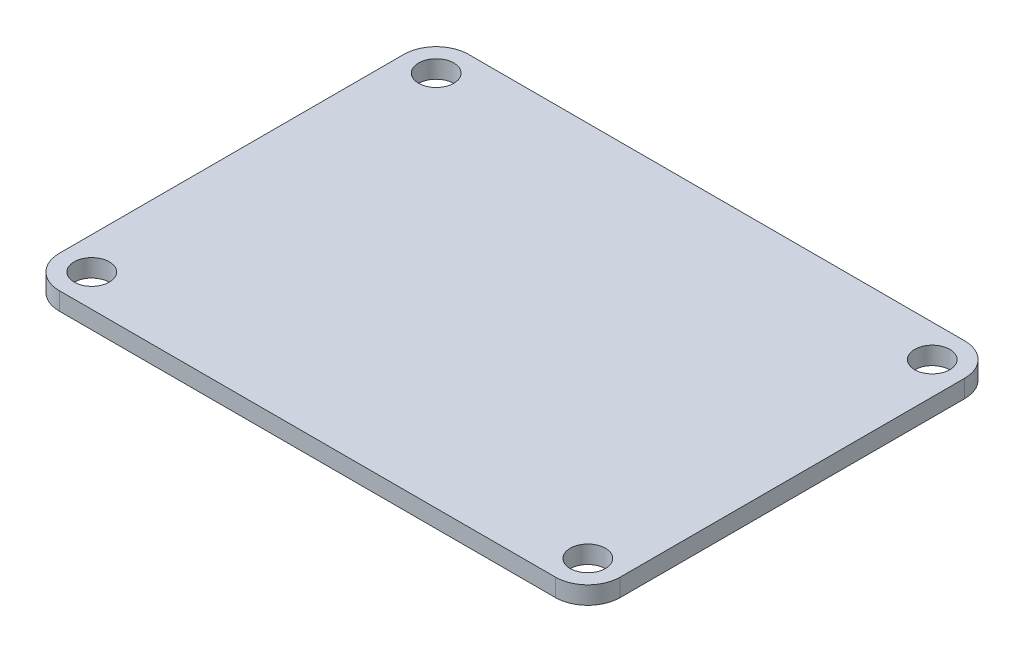
ISO-10303-21;
HEADER;
FILE_DESCRIPTION(('STEP AP214'),'2;1');
FILE_NAME('part.step','',(''),(''),'','','');
FILE_SCHEMA(('AUTOMOTIVE_DESIGN { 1 0 10303 214 1 1 1 1 }'));
ENDSEC;
DATA;
#1=APPLICATION_CONTEXT('core data for automotive mechanical design processes');
#2=APPLICATION_PROTOCOL_DEFINITION('international standard','automotive_design',2000,#1);
#3=PRODUCT_CONTEXT('',#1,'mechanical');
#4=PRODUCT('Part','Part','',(#3));
#5=PRODUCT_RELATED_PRODUCT_CATEGORY('part','',(#4));
#6=PRODUCT_DEFINITION_FORMATION('','',#4);
#7=PRODUCT_DEFINITION_CONTEXT('part definition',#1,'design');
#8=PRODUCT_DEFINITION('design','',#6,#7);
#9=PRODUCT_DEFINITION_SHAPE('','',#8);
#10=(LENGTH_UNIT() NAMED_UNIT(*) SI_UNIT(.MILLI.,.METRE.));
#11=(NAMED_UNIT(*) PLANE_ANGLE_UNIT() SI_UNIT($,.RADIAN.));
#12=(NAMED_UNIT(*) SI_UNIT($,.STERADIAN.) SOLID_ANGLE_UNIT());
#13=UNCERTAINTY_MEASURE_WITH_UNIT(LENGTH_MEASURE(1.E-05),#10,'distance_accuracy_value','');
#14=(GEOMETRIC_REPRESENTATION_CONTEXT(3) GLOBAL_UNCERTAINTY_ASSIGNED_CONTEXT((#13)) GLOBAL_UNIT_ASSIGNED_CONTEXT((#10,
#11,#12)) REPRESENTATION_CONTEXT('',''));
#15=CARTESIAN_POINT('',(0.,0.,0.));
#16=DIRECTION('',(0.,0.,1.));
#17=DIRECTION('',(1.,0.,0.));
#18=AXIS2_PLACEMENT_3D('',#15,#16,#17);
#19=CARTESIAN_POINT('',(0.,0.,0.));
#20=DIRECTION('',(0.,-1.,0.));
#21=DIRECTION('',(0.,0.,-1.));
#22=AXIS2_PLACEMENT_3D('',#19,#20,#21);
#23=PLANE('',#22);
#24=CARTESIAN_POINT('',(-22.352,0.,-15.5194));
#25=DIRECTION('',(0.,1.,0.));
#26=DIRECTION('',(0.,0.,1.));
#27=AXIS2_PLACEMENT_3D('',#24,#25,#26);
#28=CIRCLE('',#27,2.921);
#29=CARTESIAN_POINT('',(-22.352,0.,-18.4404));
#30=VERTEX_POINT('',#29);
#31=CARTESIAN_POINT('',(-25.273,0.,-15.5194));
#32=VERTEX_POINT('',#31);
#33=EDGE_CURVE('E116',#30,#32,#28,.T.);
#34=ORIENTED_EDGE('',*,*,#33,.F.);
#35=DIRECTION('',(-1.,0.,0.));
#36=VECTOR('',#35,1.);
#37=CARTESIAN_POINT('',(-25.273,0.,-18.4404));
#38=LINE('',#37,#36);
#39=CARTESIAN_POINT('',(22.352,0.,-18.4404));
#40=VERTEX_POINT('',#39);
#41=EDGE_CURVE('E110',#40,#30,#38,.T.);
#42=ORIENTED_EDGE('',*,*,#41,.F.);
#43=CARTESIAN_POINT('',(22.352,0.,-15.5194));
#44=DIRECTION('',(0.,1.,0.));
#45=DIRECTION('',(0.,0.,1.));
#46=AXIS2_PLACEMENT_3D('',#43,#44,#45);
#47=CIRCLE('',#46,2.921);
#48=CARTESIAN_POINT('',(25.273,0.,-15.5194));
#49=VERTEX_POINT('',#48);
#50=EDGE_CURVE('E142',#49,#40,#47,.T.);
#51=ORIENTED_EDGE('',*,*,#50,.F.);
#52=DIRECTION('',(0.,0.,-1.));
#53=VECTOR('',#52,1.);
#54=CARTESIAN_POINT('',(25.273,0.,-18.4404));
#55=LINE('',#54,#53);
#56=CARTESIAN_POINT('',(25.273,0.,15.5194));
#57=VERTEX_POINT('',#56);
#58=EDGE_CURVE('E85',#57,#49,#55,.T.);
#59=ORIENTED_EDGE('',*,*,#58,.F.);
#60=CARTESIAN_POINT('',(22.352,0.,15.5194));
#61=DIRECTION('',(0.,1.,0.));
#62=DIRECTION('',(0.,0.,1.));
#63=AXIS2_PLACEMENT_3D('',#60,#61,#62);
#64=CIRCLE('',#63,2.921);
#65=CARTESIAN_POINT('',(22.352,0.,18.4404));
#66=VERTEX_POINT('',#65);
#67=EDGE_CURVE('E79',#66,#57,#64,.T.);
#68=ORIENTED_EDGE('',*,*,#67,.F.);
#69=DIRECTION('',(-1.,0.,0.));
#70=VECTOR('',#69,1.);
#71=CARTESIAN_POINT('',(-25.273,0.,18.4404));
#72=LINE('',#71,#70);
#73=CARTESIAN_POINT('',(-22.352,0.,18.4404));
#74=VERTEX_POINT('',#73);
#75=EDGE_CURVE('E83',#66,#74,#72,.T.);
#76=ORIENTED_EDGE('',*,*,#75,.T.);
#77=CARTESIAN_POINT('',(-22.352,0.,15.5194));
#78=DIRECTION('',(0.,1.,0.));
#79=DIRECTION('',(0.,0.,1.));
#80=AXIS2_PLACEMENT_3D('',#77,#78,#79);
#81=CIRCLE('',#80,2.921);
#82=CARTESIAN_POINT('',(-25.273,0.,15.5194));
#83=VERTEX_POINT('',#82);
#84=EDGE_CURVE('E98',#83,#74,#81,.T.);
#85=ORIENTED_EDGE('',*,*,#84,.F.);
#86=DIRECTION('',(0.,0.,-1.));
#87=VECTOR('',#86,1.);
#88=CARTESIAN_POINT('',(-25.273,0.,-18.4404));
#89=LINE('',#88,#87);
#90=EDGE_CURVE('E114',#83,#32,#89,.T.);
#91=ORIENTED_EDGE('',*,*,#90,.T.);
#92=EDGE_LOOP('',(#34,#42,#51,#59,#68,#76,#85,#91));
#93=FACE_BOUND('',#92,.T.);
#94=CARTESIAN_POINT('',(22.352,0.,-15.5194));
#95=DIRECTION('',(0.,1.,0.));
#96=DIRECTION('',(0.,0.,1.));
#97=AXIS2_PLACEMENT_3D('',#94,#95,#96);
#98=CIRCLE('',#97,1.5875);
#99=CARTESIAN_POINT('',(22.352,0.,-13.9319));
#100=VERTEX_POINT('',#99);
#101=EDGE_CURVE('E149',#100,#100,#98,.T.);
#102=ORIENTED_EDGE('',*,*,#101,.T.);
#103=EDGE_LOOP('',(#102));
#104=FACE_BOUND('',#103,.T.);
#105=CARTESIAN_POINT('',(22.352,0.,15.5194));
#106=DIRECTION('',(0.,1.,0.));
#107=DIRECTION('',(0.,0.,1.));
#108=AXIS2_PLACEMENT_3D('',#105,#106,#107);
#109=CIRCLE('',#108,1.5875);
#110=CARTESIAN_POINT('',(22.352,0.,17.1069));
#111=VERTEX_POINT('',#110);
#112=EDGE_CURVE('E91',#111,#111,#109,.T.);
#113=ORIENTED_EDGE('',*,*,#112,.T.);
#114=EDGE_LOOP('',(#113));
#115=FACE_BOUND('',#114,.T.);
#116=CARTESIAN_POINT('',(-22.352,0.,-15.5194));
#117=DIRECTION('',(0.,1.,0.));
#118=DIRECTION('',(0.,0.,1.));
#119=AXIS2_PLACEMENT_3D('',#116,#117,#118);
#120=CIRCLE('',#119,1.5875);
#121=CARTESIAN_POINT('',(-22.352,0.,-13.9319));
#122=VERTEX_POINT('',#121);
#123=EDGE_CURVE('E151',#122,#122,#120,.T.);
#124=ORIENTED_EDGE('',*,*,#123,.T.);
#125=EDGE_LOOP('',(#124));
#126=FACE_BOUND('',#125,.T.);
#127=CARTESIAN_POINT('',(-22.352,0.,15.5194));
#128=DIRECTION('',(0.,1.,0.));
#129=DIRECTION('',(0.,0.,1.));
#130=AXIS2_PLACEMENT_3D('',#127,#128,#129);
#131=CIRCLE('',#130,1.5875);
#132=CARTESIAN_POINT('',(-22.352,0.,17.1069));
#133=VERTEX_POINT('',#132);
#134=EDGE_CURVE('E19',#133,#133,#131,.T.);
#135=ORIENTED_EDGE('',*,*,#134,.T.);
#136=EDGE_LOOP('',(#135));
#137=FACE_BOUND('',#136,.T.);
#138=ADVANCED_FACE('F16',(#93,#104,#115,#126,#137),#23,.T.);
#139=CARTESIAN_POINT('',(-22.352,0.,15.5194));
#140=DIRECTION('',(0.,1.,0.));
#141=DIRECTION('',(0.,0.,1.));
#142=AXIS2_PLACEMENT_3D('',#139,#140,#141);
#143=CYLINDRICAL_SURFACE('',#142,1.5875);
#144=ORIENTED_EDGE('',*,*,#134,.F.);
#145=EDGE_LOOP('',(#144));
#146=FACE_BOUND('',#145,.T.);
#147=CARTESIAN_POINT('',(-22.352,1.6002,15.5194));
#148=DIRECTION('',(0.,1.,0.));
#149=DIRECTION('',(0.,0.,1.));
#150=AXIS2_PLACEMENT_3D('',#147,#148,#149);
#151=CIRCLE('',#150,1.5875);
#152=CARTESIAN_POINT('',(-22.352,1.6002,17.1069));
#153=VERTEX_POINT('',#152);
#154=EDGE_CURVE('E108',#153,#153,#151,.T.);
#155=ORIENTED_EDGE('',*,*,#154,.T.);
#156=EDGE_LOOP('',(#155));
#157=FACE_BOUND('',#156,.T.);
#158=ADVANCED_FACE('F159',(#146,#157),#143,.F.);
#159=CARTESIAN_POINT('',(-22.352,0.,-15.5194));
#160=DIRECTION('',(0.,1.,0.));
#161=DIRECTION('',(0.,0.,1.));
#162=AXIS2_PLACEMENT_3D('',#159,#160,#161);
#163=CYLINDRICAL_SURFACE('',#162,1.5875);
#164=ORIENTED_EDGE('',*,*,#123,.F.);
#165=EDGE_LOOP('',(#164));
#166=FACE_BOUND('',#165,.T.);
#167=CARTESIAN_POINT('',(-22.352,1.6002,-15.5194));
#168=DIRECTION('',(0.,1.,0.));
#169=DIRECTION('',(0.,0.,1.));
#170=AXIS2_PLACEMENT_3D('',#167,#168,#169);
#171=CIRCLE('',#170,1.5875);
#172=CARTESIAN_POINT('',(-22.352,1.6002,-13.9319));
#173=VERTEX_POINT('',#172);
#174=EDGE_CURVE('E137',#173,#173,#171,.T.);
#175=ORIENTED_EDGE('',*,*,#174,.T.);
#176=EDGE_LOOP('',(#175));
#177=FACE_BOUND('',#176,.T.);
#178=ADVANCED_FACE('F162',(#166,#177),#163,.F.);
#179=CARTESIAN_POINT('',(22.352,0.,-15.5194));
#180=DIRECTION('',(0.,1.,0.));
#181=DIRECTION('',(0.,0.,1.));
#182=AXIS2_PLACEMENT_3D('',#179,#180,#181);
#183=CYLINDRICAL_SURFACE('',#182,1.5875);
#184=ORIENTED_EDGE('',*,*,#101,.F.);
#185=EDGE_LOOP('',(#184));
#186=FACE_BOUND('',#185,.T.);
#187=CARTESIAN_POINT('',(22.352,1.6002,-15.5194));
#188=DIRECTION('',(0.,1.,0.));
#189=DIRECTION('',(0.,0.,1.));
#190=AXIS2_PLACEMENT_3D('',#187,#188,#189);
#191=CIRCLE('',#190,1.5875);
#192=CARTESIAN_POINT('',(22.352,1.6002,-13.9319));
#193=VERTEX_POINT('',#192);
#194=EDGE_CURVE('E134',#193,#193,#191,.T.);
#195=ORIENTED_EDGE('',*,*,#194,.T.);
#196=EDGE_LOOP('',(#195));
#197=FACE_BOUND('',#196,.T.);
#198=ADVANCED_FACE('F205',(#186,#197),#183,.F.);
#199=CARTESIAN_POINT('',(22.352,0.,15.5194));
#200=DIRECTION('',(0.,1.,0.));
#201=DIRECTION('',(0.,0.,1.));
#202=AXIS2_PLACEMENT_3D('',#199,#200,#201);
#203=CYLINDRICAL_SURFACE('',#202,1.5875);
#204=ORIENTED_EDGE('',*,*,#112,.F.);
#205=EDGE_LOOP('',(#204));
#206=FACE_BOUND('',#205,.T.);
#207=CARTESIAN_POINT('',(22.352,1.6002,15.5194));
#208=DIRECTION('',(0.,1.,0.));
#209=DIRECTION('',(0.,0.,1.));
#210=AXIS2_PLACEMENT_3D('',#207,#208,#209);
#211=CIRCLE('',#210,1.5875);
#212=CARTESIAN_POINT('',(22.352,1.6002,17.1069));
#213=VERTEX_POINT('',#212);
#214=EDGE_CURVE('E131',#213,#213,#211,.T.);
#215=ORIENTED_EDGE('',*,*,#214,.T.);
#216=EDGE_LOOP('',(#215));
#217=FACE_BOUND('',#216,.T.);
#218=ADVANCED_FACE('F202',(#206,#217),#203,.F.);
#219=CARTESIAN_POINT('',(22.352,0.,15.5194));
#220=DIRECTION('',(0.,1.,0.));
#221=DIRECTION('',(0.,0.,1.));
#222=AXIS2_PLACEMENT_3D('',#219,#220,#221);
#223=CYLINDRICAL_SURFACE('',#222,2.921);
#224=ORIENTED_EDGE('',*,*,#67,.T.);
#225=DIRECTION('',(0.,1.,0.));
#226=VECTOR('',#225,1.);
#227=CARTESIAN_POINT('',(25.273,1.6002,15.5194));
#228=LINE('',#227,#226);
#229=CARTESIAN_POINT('',(25.273,1.6002,15.5194));
#230=VERTEX_POINT('',#229);
#231=EDGE_CURVE('E109',#230,#57,#228,.F.);
#232=ORIENTED_EDGE('',*,*,#231,.F.);
#233=CARTESIAN_POINT('',(22.352,1.6002,15.5194));
#234=DIRECTION('',(0.,1.,0.));
#235=DIRECTION('',(0.,0.,1.));
#236=AXIS2_PLACEMENT_3D('',#233,#234,#235);
#237=CIRCLE('',#236,2.921);
#238=CARTESIAN_POINT('',(22.352,1.6002,18.4404));
#239=VERTEX_POINT('',#238);
#240=EDGE_CURVE('E102',#230,#239,#237,.F.);
#241=ORIENTED_EDGE('',*,*,#240,.T.);
#242=DIRECTION('',(0.,1.,0.));
#243=VECTOR('',#242,1.);
#244=CARTESIAN_POINT('',(22.352,1.6002,18.4404));
#245=LINE('',#244,#243);
#246=EDGE_CURVE('E90',#239,#66,#245,.F.);
#247=ORIENTED_EDGE('',*,*,#246,.T.);
#248=EDGE_LOOP('',(#224,#232,#241,#247));
#249=FACE_BOUND('',#248,.T.);
#250=ADVANCED_FACE('F101',(#249),#223,.T.);
#251=CARTESIAN_POINT('',(-25.273,1.6002,18.4404));
#252=DIRECTION('',(0.,0.,-1.));
#253=DIRECTION('',(-1.,0.,0.));
#254=AXIS2_PLACEMENT_3D('',#251,#252,#253);
#255=PLANE('',#254);
#256=ORIENTED_EDGE('',*,*,#246,.F.);
#257=DIRECTION('',(1.,0.,0.));
#258=VECTOR('',#257,1.);
#259=CARTESIAN_POINT('',(0.,1.6002,18.4404));
#260=LINE('',#259,#258);
#261=CARTESIAN_POINT('',(-22.352,1.6002,18.4404));
#262=VERTEX_POINT('',#261);
#263=EDGE_CURVE('E129',#239,#262,#260,.F.);
#264=ORIENTED_EDGE('',*,*,#263,.T.);
#265=DIRECTION('',(0.,1.,0.));
#266=VECTOR('',#265,1.);
#267=CARTESIAN_POINT('',(-22.352,0.,18.4404));
#268=LINE('',#267,#266);
#269=EDGE_CURVE('E97',#74,#262,#268,.T.);
#270=ORIENTED_EDGE('',*,*,#269,.F.);
#271=ORIENTED_EDGE('',*,*,#75,.F.);
#272=EDGE_LOOP('',(#256,#264,#270,#271));
#273=FACE_BOUND('',#272,.T.);
#274=ADVANCED_FACE('F94',(#273),#255,.F.);
#275=CARTESIAN_POINT('',(-22.352,0.,15.5194));
#276=DIRECTION('',(0.,1.,0.));
#277=DIRECTION('',(0.,0.,1.));
#278=AXIS2_PLACEMENT_3D('',#275,#276,#277);
#279=CYLINDRICAL_SURFACE('',#278,2.921);
#280=ORIENTED_EDGE('',*,*,#84,.T.);
#281=ORIENTED_EDGE('',*,*,#269,.T.);
#282=CARTESIAN_POINT('',(-22.352,1.6002,15.5194));
#283=DIRECTION('',(0.,1.,0.));
#284=DIRECTION('',(0.,0.,1.));
#285=AXIS2_PLACEMENT_3D('',#282,#283,#284);
#286=CIRCLE('',#285,2.921);
#287=CARTESIAN_POINT('',(-25.273,1.6002,15.5194));
#288=VERTEX_POINT('',#287);
#289=EDGE_CURVE('E126',#262,#288,#286,.F.);
#290=ORIENTED_EDGE('',*,*,#289,.T.);
#291=DIRECTION('',(0.,1.,0.));
#292=VECTOR('',#291,1.);
#293=CARTESIAN_POINT('',(-25.273,1.6002,15.5194));
#294=LINE('',#293,#292);
#295=EDGE_CURVE('E117',#288,#83,#294,.F.);
#296=ORIENTED_EDGE('',*,*,#295,.T.);
#297=EDGE_LOOP('',(#280,#281,#290,#296));
#298=FACE_BOUND('',#297,.T.);
#299=ADVANCED_FACE('F193',(#298),#279,.T.);
#300=CARTESIAN_POINT('',(-25.273,1.6002,-18.4404));
#301=DIRECTION('',(1.,0.,0.));
#302=DIRECTION('',(0.,0.,-1.));
#303=AXIS2_PLACEMENT_3D('',#300,#301,#302);
#304=PLANE('',#303);
#305=ORIENTED_EDGE('',*,*,#295,.F.);
#306=DIRECTION('',(0.,0.,-1.));
#307=VECTOR('',#306,1.);
#308=CARTESIAN_POINT('',(-25.273,1.6002,0.));
#309=LINE('',#308,#307);
#310=CARTESIAN_POINT('',(-25.273,1.6002,-15.5194));
#311=VERTEX_POINT('',#310);
#312=EDGE_CURVE('E125',#288,#311,#309,.T.);
#313=ORIENTED_EDGE('',*,*,#312,.T.);
#314=DIRECTION('',(0.,1.,0.));
#315=VECTOR('',#314,1.);
#316=CARTESIAN_POINT('',(-25.273,0.,-15.5194));
#317=LINE('',#316,#315);
#318=EDGE_CURVE('E113',#32,#311,#317,.T.);
#319=ORIENTED_EDGE('',*,*,#318,.F.);
#320=ORIENTED_EDGE('',*,*,#90,.F.);
#321=EDGE_LOOP('',(#305,#313,#319,#320));
#322=FACE_BOUND('',#321,.T.);
#323=ADVANCED_FACE('F189',(#322),#304,.F.);
#324=CARTESIAN_POINT('',(-22.352,0.,-15.5194));
#325=DIRECTION('',(0.,1.,0.));
#326=DIRECTION('',(0.,0.,1.));
#327=AXIS2_PLACEMENT_3D('',#324,#325,#326);
#328=CYLINDRICAL_SURFACE('',#327,2.921);
#329=ORIENTED_EDGE('',*,*,#33,.T.);
#330=ORIENTED_EDGE('',*,*,#318,.T.);
#331=CARTESIAN_POINT('',(-22.352,1.6002,-15.5194));
#332=DIRECTION('',(0.,1.,0.));
#333=DIRECTION('',(0.,0.,1.));
#334=AXIS2_PLACEMENT_3D('',#331,#332,#333);
#335=CIRCLE('',#334,2.921);
#336=CARTESIAN_POINT('',(-22.352,1.6002,-18.4404));
#337=VERTEX_POINT('',#336);
#338=EDGE_CURVE('E122',#311,#337,#335,.F.);
#339=ORIENTED_EDGE('',*,*,#338,.T.);
#340=DIRECTION('',(0.,1.,0.));
#341=VECTOR('',#340,1.);
#342=CARTESIAN_POINT('',(-22.352,1.6002,-18.4404));
#343=LINE('',#342,#341);
#344=EDGE_CURVE('E112',#30,#337,#343,.T.);
#345=ORIENTED_EDGE('',*,*,#344,.F.);
#346=EDGE_LOOP('',(#329,#330,#339,#345));
#347=FACE_BOUND('',#346,.T.);
#348=ADVANCED_FACE('F185',(#347),#328,.T.);
#349=CARTESIAN_POINT('',(-25.273,1.6002,-18.4404));
#350=DIRECTION('',(0.,0.,-1.));
#351=DIRECTION('',(-1.,0.,0.));
#352=AXIS2_PLACEMENT_3D('',#349,#350,#351);
#353=PLANE('',#352);
#354=ORIENTED_EDGE('',*,*,#41,.T.);
#355=ORIENTED_EDGE('',*,*,#344,.T.);
#356=DIRECTION('',(1.,0.,0.));
#357=VECTOR('',#356,1.);
#358=CARTESIAN_POINT('',(0.,1.6002,-18.4404));
#359=LINE('',#358,#357);
#360=CARTESIAN_POINT('',(22.352,1.6002,-18.4404));
#361=VERTEX_POINT('',#360);
#362=EDGE_CURVE('E121',#337,#361,#359,.T.);
#363=ORIENTED_EDGE('',*,*,#362,.T.);
#364=DIRECTION('',(0.,1.,0.));
#365=VECTOR('',#364,1.);
#366=CARTESIAN_POINT('',(22.352,0.,-18.4404));
#367=LINE('',#366,#365);
#368=EDGE_CURVE('E144',#40,#361,#367,.T.);
#369=ORIENTED_EDGE('',*,*,#368,.F.);
#370=EDGE_LOOP('',(#354,#355,#363,#369));
#371=FACE_BOUND('',#370,.T.);
#372=ADVANCED_FACE('F181',(#371),#353,.T.);
#373=CARTESIAN_POINT('',(22.352,0.,-15.5194));
#374=DIRECTION('',(0.,1.,0.));
#375=DIRECTION('',(0.,0.,1.));
#376=AXIS2_PLACEMENT_3D('',#373,#374,#375);
#377=CYLINDRICAL_SURFACE('',#376,2.921);
#378=ORIENTED_EDGE('',*,*,#50,.T.);
#379=ORIENTED_EDGE('',*,*,#368,.T.);
#380=CARTESIAN_POINT('',(22.352,1.6002,-15.5194));
#381=DIRECTION('',(0.,1.,0.));
#382=DIRECTION('',(0.,0.,1.));
#383=AXIS2_PLACEMENT_3D('',#380,#381,#382);
#384=CIRCLE('',#383,2.921);
#385=CARTESIAN_POINT('',(25.273,1.6002,-15.5194));
#386=VERTEX_POINT('',#385);
#387=EDGE_CURVE('E25',#361,#386,#384,.F.);
#388=ORIENTED_EDGE('',*,*,#387,.T.);
#389=DIRECTION('',(0.,1.,0.));
#390=VECTOR('',#389,1.);
#391=CARTESIAN_POINT('',(25.273,1.6002,-15.5194));
#392=LINE('',#391,#390);
#393=EDGE_CURVE('E33',#49,#386,#392,.T.);
#394=ORIENTED_EDGE('',*,*,#393,.F.);
#395=EDGE_LOOP('',(#378,#379,#388,#394));
#396=FACE_BOUND('',#395,.T.);
#397=ADVANCED_FACE('F174',(#396),#377,.T.);
#398=CARTESIAN_POINT('',(25.273,1.6002,-18.4404));
#399=DIRECTION('',(1.,0.,0.));
#400=DIRECTION('',(0.,0.,-1.));
#401=AXIS2_PLACEMENT_3D('',#398,#399,#400);
#402=PLANE('',#401);
#403=ORIENTED_EDGE('',*,*,#231,.T.);
#404=ORIENTED_EDGE('',*,*,#58,.T.);
#405=ORIENTED_EDGE('',*,*,#393,.T.);
#406=DIRECTION('',(0.,0.,-1.));
#407=VECTOR('',#406,1.);
#408=CARTESIAN_POINT('',(25.273,1.6002,0.));
#409=LINE('',#408,#407);
#410=EDGE_CURVE('E11',#386,#230,#409,.F.);
#411=ORIENTED_EDGE('',*,*,#410,.T.);
#412=EDGE_LOOP('',(#403,#404,#405,#411));
#413=FACE_BOUND('',#412,.T.);
#414=ADVANCED_FACE('F167',(#413),#402,.T.);
#415=CARTESIAN_POINT('',(0.,1.6002,0.));
#416=DIRECTION('',(0.,-1.,0.));
#417=DIRECTION('',(0.,0.,-1.));
#418=AXIS2_PLACEMENT_3D('',#415,#416,#417);
#419=PLANE('',#418);
#420=ORIENTED_EDGE('',*,*,#387,.F.);
#421=ORIENTED_EDGE('',*,*,#362,.F.);
#422=ORIENTED_EDGE('',*,*,#338,.F.);
#423=ORIENTED_EDGE('',*,*,#312,.F.);
#424=ORIENTED_EDGE('',*,*,#289,.F.);
#425=ORIENTED_EDGE('',*,*,#263,.F.);
#426=ORIENTED_EDGE('',*,*,#240,.F.);
#427=ORIENTED_EDGE('',*,*,#410,.F.);
#428=EDGE_LOOP('',(#420,#421,#422,#423,#424,#425,#426,#427));
#429=FACE_BOUND('',#428,.T.);
#430=ORIENTED_EDGE('',*,*,#214,.F.);
#431=EDGE_LOOP('',(#430));
#432=FACE_BOUND('',#431,.T.);
#433=ORIENTED_EDGE('',*,*,#194,.F.);
#434=EDGE_LOOP('',(#433));
#435=FACE_BOUND('',#434,.T.);
#436=ORIENTED_EDGE('',*,*,#174,.F.);
#437=EDGE_LOOP('',(#436));
#438=FACE_BOUND('',#437,.T.);
#439=ORIENTED_EDGE('',*,*,#154,.F.);
#440=EDGE_LOOP('',(#439));
#441=FACE_BOUND('',#440,.T.);
#442=ADVANCED_FACE('F165',(#429,#432,#435,#438,#441),#419,.F.);
#443=CLOSED_SHELL('',(#138,#158,#178,#198,#218,#250,#274,#299,#323,#348,#372,#397,#414,#442));
#444=MANIFOLD_SOLID_BREP('B1',#443);
#445=ADVANCED_BREP_SHAPE_REPRESENTATION('',(#18,#444),#14);
#446=SHAPE_DEFINITION_REPRESENTATION(#9,#445);
ENDSEC;
END-ISO-10303-21;
